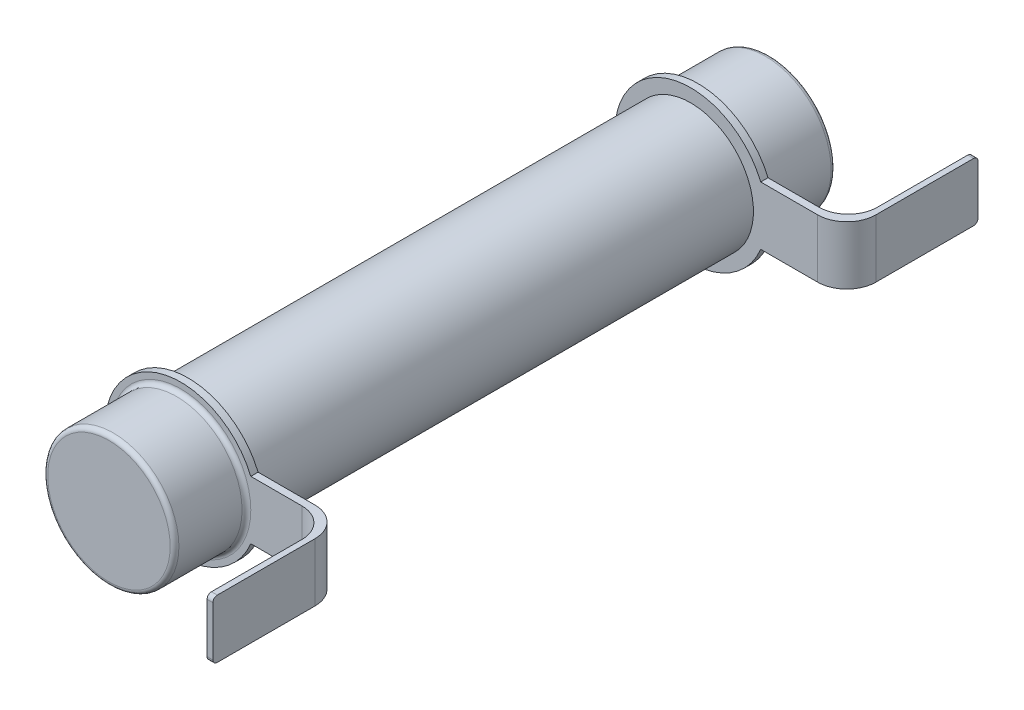
ISO-10303-21;
HEADER;
FILE_DESCRIPTION(('STEP AP214'),'2;1');
FILE_NAME('part.step','',(''),(''),'','','');
FILE_SCHEMA(('AUTOMOTIVE_DESIGN { 1 0 10303 214 1 1 1 1 }'));
ENDSEC;
DATA;
#1=APPLICATION_CONTEXT('core data for automotive mechanical design processes');
#2=APPLICATION_PROTOCOL_DEFINITION('international standard','automotive_design',2000,#1);
#3=PRODUCT_CONTEXT('',#1,'mechanical');
#4=PRODUCT('Part','Part','',(#3));
#5=PRODUCT_RELATED_PRODUCT_CATEGORY('part','',(#4));
#6=PRODUCT_DEFINITION_FORMATION('','',#4);
#7=PRODUCT_DEFINITION_CONTEXT('part definition',#1,'design');
#8=PRODUCT_DEFINITION('design','',#6,#7);
#9=PRODUCT_DEFINITION_SHAPE('','',#8);
#10=(LENGTH_UNIT() NAMED_UNIT(*) SI_UNIT(.MILLI.,.METRE.));
#11=(NAMED_UNIT(*) PLANE_ANGLE_UNIT() SI_UNIT($,.RADIAN.));
#12=(NAMED_UNIT(*) SI_UNIT($,.STERADIAN.) SOLID_ANGLE_UNIT());
#13=UNCERTAINTY_MEASURE_WITH_UNIT(LENGTH_MEASURE(1.E-05),#10,'distance_accuracy_value','');
#14=(GEOMETRIC_REPRESENTATION_CONTEXT(3) GLOBAL_UNCERTAINTY_ASSIGNED_CONTEXT((#13)) GLOBAL_UNIT_ASSIGNED_CONTEXT((#10,
#11,#12)) REPRESENTATION_CONTEXT('',''));
#15=CARTESIAN_POINT('',(0.,0.,0.));
#16=DIRECTION('',(0.,0.,1.));
#17=DIRECTION('',(1.,0.,0.));
#18=AXIS2_PLACEMENT_3D('',#15,#16,#17);
#19=CARTESIAN_POINT('',(0.,0.,17.735));
#20=DIRECTION('',(0.,0.,-1.));
#21=DIRECTION('',(-1.,0.,0.));
#22=AXIS2_PLACEMENT_3D('',#19,#20,#21);
#23=CYLINDRICAL_SURFACE('',#22,5.2);
#24=DIRECTION('',(0.,0.,-1.));
#25=VECTOR('',#24,1.);
#26=CARTESIAN_POINT('',(4.8,2.,17.735));
#27=LINE('',#26,#25);
#28=CARTESIAN_POINT('',(4.8,2.,17.735));
#29=VERTEX_POINT('',#28);
#30=CARTESIAN_POINT('',(4.8,2.,17.235));
#31=VERTEX_POINT('',#30);
#32=EDGE_CURVE('E201',#29,#31,#27,.T.);
#33=ORIENTED_EDGE('',*,*,#32,.T.);
#34=CARTESIAN_POINT('',(0.,0.,17.235));
#35=DIRECTION('',(0.,0.,1.));
#36=DIRECTION('',(1.,0.,0.));
#37=AXIS2_PLACEMENT_3D('',#34,#35,#36);
#38=CIRCLE('',#37,5.2);
#39=CARTESIAN_POINT('',(4.8,-2.,17.235));
#40=VERTEX_POINT('',#39);
#41=EDGE_CURVE('E186',#31,#40,#38,.T.);
#42=ORIENTED_EDGE('',*,*,#41,.T.);
#43=DIRECTION('',(0.,0.,-1.));
#44=VECTOR('',#43,1.);
#45=CARTESIAN_POINT('',(4.8,-2.,17.735));
#46=LINE('',#45,#44);
#47=CARTESIAN_POINT('',(4.8,-2.,17.735));
#48=VERTEX_POINT('',#47);
#49=EDGE_CURVE('E208',#40,#48,#46,.F.);
#50=ORIENTED_EDGE('',*,*,#49,.T.);
#51=CARTESIAN_POINT('',(0.,0.,17.735));
#52=DIRECTION('',(0.,0.,1.));
#53=DIRECTION('',(1.,0.,0.));
#54=AXIS2_PLACEMENT_3D('',#51,#52,#53);
#55=CIRCLE('',#54,5.2);
#56=EDGE_CURVE('E197',#29,#48,#55,.T.);
#57=ORIENTED_EDGE('',*,*,#56,.F.);
#58=EDGE_LOOP('',(#33,#42,#50,#57));
#59=FACE_BOUND('',#58,.T.);
#60=ADVANCED_FACE('F45',(#59),#23,.T.);
#61=CARTESIAN_POINT('',(0.,0.,-17.735));
#62=DIRECTION('',(0.,0.,1.));
#63=DIRECTION('',(1.,0.,0.));
#64=AXIS2_PLACEMENT_3D('',#61,#62,#63);
#65=CYLINDRICAL_SURFACE('',#64,5.2);
#66=CARTESIAN_POINT('',(0.,0.,-17.235));
#67=DIRECTION('',(0.,0.,1.));
#68=DIRECTION('',(1.,0.,0.));
#69=AXIS2_PLACEMENT_3D('',#66,#67,#68);
#70=CIRCLE('',#69,5.2);
#71=CARTESIAN_POINT('',(4.8,2.,-17.235));
#72=VERTEX_POINT('',#71);
#73=CARTESIAN_POINT('',(4.8,-2.,-17.235));
#74=VERTEX_POINT('',#73);
#75=EDGE_CURVE('E282',#72,#74,#70,.T.);
#76=ORIENTED_EDGE('',*,*,#75,.F.);
#77=DIRECTION('',(0.,0.,1.));
#78=VECTOR('',#77,1.);
#79=CARTESIAN_POINT('',(4.8,2.,-17.735));
#80=LINE('',#79,#78);
#81=CARTESIAN_POINT('',(4.8,2.,-17.735));
#82=VERTEX_POINT('',#81);
#83=EDGE_CURVE('E262',#82,#72,#80,.T.);
#84=ORIENTED_EDGE('',*,*,#83,.F.);
#85=CARTESIAN_POINT('',(0.,0.,-17.735));
#86=DIRECTION('',(0.,0.,1.));
#87=DIRECTION('',(1.,0.,0.));
#88=AXIS2_PLACEMENT_3D('',#85,#86,#87);
#89=CIRCLE('',#88,5.2);
#90=CARTESIAN_POINT('',(4.8,-2.,-17.735));
#91=VERTEX_POINT('',#90);
#92=EDGE_CURVE('E198',#82,#91,#89,.T.);
#93=ORIENTED_EDGE('',*,*,#92,.T.);
#94=DIRECTION('',(0.,0.,1.));
#95=VECTOR('',#94,1.);
#96=CARTESIAN_POINT('',(4.8,-2.,-17.735));
#97=LINE('',#96,#95);
#98=EDGE_CURVE('E256',#74,#91,#97,.F.);
#99=ORIENTED_EDGE('',*,*,#98,.F.);
#100=EDGE_LOOP('',(#76,#84,#93,#99));
#101=FACE_BOUND('',#100,.T.);
#102=ADVANCED_FACE('F439',(#101),#65,.T.);
#103=CARTESIAN_POINT('',(0.,0.,22.665));
#104=DIRECTION('',(0.,0.,-1.));
#105=DIRECTION('',(-1.,0.,0.));
#106=AXIS2_PLACEMENT_3D('',#103,#104,#105);
#107=CYLINDRICAL_SURFACE('',#106,4.3);
#108=CARTESIAN_POINT('',(0.,0.,17.235));
#109=DIRECTION('',(0.,0.,1.));
#110=DIRECTION('',(1.,0.,0.));
#111=AXIS2_PLACEMENT_3D('',#108,#109,#110);
#112=CIRCLE('',#111,4.3);
#113=CARTESIAN_POINT('',(4.3,0.,17.235));
#114=VERTEX_POINT('',#113);
#115=EDGE_CURVE('E288',#114,#114,#112,.T.);
#116=ORIENTED_EDGE('',*,*,#115,.F.);
#117=EDGE_LOOP('',(#116));
#118=FACE_BOUND('',#117,.T.);
#119=CARTESIAN_POINT('',(0.,0.,-17.235));
#120=DIRECTION('',(0.,0.,-1.));
#121=DIRECTION('',(-1.,0.,0.));
#122=AXIS2_PLACEMENT_3D('',#119,#120,#121);
#123=CIRCLE('',#122,4.3);
#124=CARTESIAN_POINT('',(-4.3,0.,-17.235));
#125=VERTEX_POINT('',#124);
#126=EDGE_CURVE('E293',#125,#125,#123,.T.);
#127=ORIENTED_EDGE('',*,*,#126,.F.);
#128=EDGE_LOOP('',(#127));
#129=FACE_BOUND('',#128,.T.);
#130=ADVANCED_FACE('F475',(#118,#129),#107,.T.);
#131=CARTESIAN_POINT('',(0.,0.,17.235));
#132=DIRECTION('',(0.,0.,1.));
#133=DIRECTION('',(1.,0.,0.));
#134=AXIS2_PLACEMENT_3D('',#131,#132,#133);
#135=PLANE('',#134);
#136=ORIENTED_EDGE('',*,*,#115,.T.);
#137=EDGE_LOOP('',(#136));
#138=FACE_BOUND('',#137,.T.);
#139=DIRECTION('',(1.,0.,0.));
#140=VECTOR('',#139,1.);
#141=CARTESIAN_POINT('',(-5.201,2.,17.235));
#142=LINE('',#141,#140);
#143=CARTESIAN_POINT('',(8.7,2.,17.235));
#144=VERTEX_POINT('',#143);
#145=EDGE_CURVE('E190',#31,#144,#142,.T.);
#146=ORIENTED_EDGE('',*,*,#145,.T.);
#147=DIRECTION('',(0.,1.,0.));
#148=VECTOR('',#147,1.);
#149=CARTESIAN_POINT('',(8.7,-2.,17.235));
#150=LINE('',#149,#148);
#151=CARTESIAN_POINT('',(8.7,-2.,17.235));
#152=VERTEX_POINT('',#151);
#153=EDGE_CURVE('E301',#144,#152,#150,.F.);
#154=ORIENTED_EDGE('',*,*,#153,.T.);
#155=DIRECTION('',(1.,0.,0.));
#156=VECTOR('',#155,1.);
#157=CARTESIAN_POINT('',(-5.201,-2.,17.235));
#158=LINE('',#157,#156);
#159=EDGE_CURVE('E193',#40,#152,#158,.T.);
#160=ORIENTED_EDGE('',*,*,#159,.F.);
#161=ORIENTED_EDGE('',*,*,#41,.F.);
#162=EDGE_LOOP('',(#146,#154,#160,#161));
#163=FACE_BOUND('',#162,.T.);
#164=ADVANCED_FACE('F188',(#138,#163),#135,.F.);
#165=CARTESIAN_POINT('',(0.,0.,17.735));
#166=DIRECTION('',(0.,0.,1.));
#167=DIRECTION('',(1.,0.,0.));
#168=AXIS2_PLACEMENT_3D('',#165,#166,#167);
#169=PLANE('',#168);
#170=CARTESIAN_POINT('',(0.,0.,17.735));
#171=DIRECTION('',(0.,0.,1.));
#172=DIRECTION('',(1.,0.,0.));
#173=AXIS2_PLACEMENT_3D('',#170,#171,#172);
#174=CIRCLE('',#173,4.8);
#175=CARTESIAN_POINT('',(4.8,0.,17.735));
#176=VERTEX_POINT('',#175);
#177=EDGE_CURVE('E11',#176,#176,#174,.F.);
#178=ORIENTED_EDGE('',*,*,#177,.T.);
#179=EDGE_LOOP('',(#178));
#180=FACE_BOUND('',#179,.T.);
#181=DIRECTION('',(1.,0.,0.));
#182=VECTOR('',#181,1.);
#183=CARTESIAN_POINT('',(-5.201,-2.,17.735));
#184=LINE('',#183,#182);
#185=CARTESIAN_POINT('',(8.3,-2.,17.735));
#186=VERTEX_POINT('',#185);
#187=EDGE_CURVE('E222',#48,#186,#184,.T.);
#188=ORIENTED_EDGE('',*,*,#187,.T.);
#189=DIRECTION('',(0.,1.,0.));
#190=VECTOR('',#189,1.);
#191=CARTESIAN_POINT('',(8.3,0.,17.735));
#192=LINE('',#191,#190);
#193=CARTESIAN_POINT('',(8.3,2.,17.735));
#194=VERTEX_POINT('',#193);
#195=EDGE_CURVE('E304',#186,#194,#192,.T.);
#196=ORIENTED_EDGE('',*,*,#195,.T.);
#197=DIRECTION('',(1.,0.,0.));
#198=VECTOR('',#197,1.);
#199=CARTESIAN_POINT('',(-5.201,2.,17.735));
#200=LINE('',#199,#198);
#201=EDGE_CURVE('E215',#29,#194,#200,.T.);
#202=ORIENTED_EDGE('',*,*,#201,.F.);
#203=ORIENTED_EDGE('',*,*,#56,.T.);
#204=EDGE_LOOP('',(#188,#196,#202,#203));
#205=FACE_BOUND('',#204,.T.);
#206=ADVANCED_FACE('F479',(#180,#205),#169,.T.);
#207=CARTESIAN_POINT('',(0.,0.,22.665));
#208=DIRECTION('',(0.,0.,1.));
#209=DIRECTION('',(1.,0.,0.));
#210=AXIS2_PLACEMENT_3D('',#207,#208,#209);
#211=PLANE('',#210);
#212=CARTESIAN_POINT('',(0.,0.,22.665));
#213=DIRECTION('',(0.,0.,1.));
#214=DIRECTION('',(1.,0.,0.));
#215=AXIS2_PLACEMENT_3D('',#212,#213,#214);
#216=CIRCLE('',#215,4.2);
#217=CARTESIAN_POINT('',(4.2,0.,22.665));
#218=VERTEX_POINT('',#217);
#219=EDGE_CURVE('E360',#218,#218,#216,.T.);
#220=ORIENTED_EDGE('',*,*,#219,.T.);
#221=EDGE_LOOP('',(#220));
#222=FACE_BOUND('',#221,.T.);
#223=ADVANCED_FACE('F486',(#222),#211,.T.);
#224=CARTESIAN_POINT('',(0.,0.,17.235));
#225=DIRECTION('',(0.,0.,1.));
#226=DIRECTION('',(1.,0.,0.));
#227=AXIS2_PLACEMENT_3D('',#224,#225,#226);
#228=CYLINDRICAL_SURFACE('',#227,4.5);
#229=CARTESIAN_POINT('',(0.,0.,22.365));
#230=DIRECTION('',(0.,0.,1.));
#231=DIRECTION('',(1.,0.,0.));
#232=AXIS2_PLACEMENT_3D('',#229,#230,#231);
#233=CIRCLE('',#232,4.5);
#234=CARTESIAN_POINT('',(4.5,0.,22.365));
#235=VERTEX_POINT('',#234);
#236=EDGE_CURVE('E368',#235,#235,#233,.F.);
#237=ORIENTED_EDGE('',*,*,#236,.T.);
#238=EDGE_LOOP('',(#237));
#239=FACE_BOUND('',#238,.T.);
#240=CARTESIAN_POINT('',(0.,0.,18.035));
#241=DIRECTION('',(0.,0.,1.));
#242=DIRECTION('',(1.,0.,0.));
#243=AXIS2_PLACEMENT_3D('',#240,#241,#242);
#244=CIRCLE('',#243,4.5);
#245=CARTESIAN_POINT('',(4.5,0.,18.035));
#246=VERTEX_POINT('',#245);
#247=EDGE_CURVE('E364',#246,#246,#244,.T.);
#248=ORIENTED_EDGE('',*,*,#247,.T.);
#249=EDGE_LOOP('',(#248));
#250=FACE_BOUND('',#249,.T.);
#251=ADVANCED_FACE('F483',(#239,#250),#228,.T.);
#252=CARTESIAN_POINT('',(0.,0.,-17.235));
#253=DIRECTION('',(0.,0.,-1.));
#254=DIRECTION('',(1.,0.,0.));
#255=AXIS2_PLACEMENT_3D('',#252,#253,#254);
#256=PLANE('',#255);
#257=ORIENTED_EDGE('',*,*,#126,.T.);
#258=EDGE_LOOP('',(#257));
#259=FACE_BOUND('',#258,.T.);
#260=DIRECTION('',(1.,0.,0.));
#261=VECTOR('',#260,1.);
#262=CARTESIAN_POINT('',(-5.201,-2.,-17.235));
#263=LINE('',#262,#261);
#264=CARTESIAN_POINT('',(8.7,-2.,-17.235));
#265=VERTEX_POINT('',#264);
#266=EDGE_CURVE('E246',#74,#265,#263,.T.);
#267=ORIENTED_EDGE('',*,*,#266,.T.);
#268=DIRECTION('',(0.,-1.,0.));
#269=VECTOR('',#268,1.);
#270=CARTESIAN_POINT('',(8.7,2.,-17.235));
#271=LINE('',#270,#269);
#272=CARTESIAN_POINT('',(8.7,2.,-17.235));
#273=VERTEX_POINT('',#272);
#274=EDGE_CURVE('E316',#265,#273,#271,.F.);
#275=ORIENTED_EDGE('',*,*,#274,.T.);
#276=DIRECTION('',(1.,0.,0.));
#277=VECTOR('',#276,1.);
#278=CARTESIAN_POINT('',(-5.201,2.,-17.235));
#279=LINE('',#278,#277);
#280=EDGE_CURVE('E266',#72,#273,#279,.T.);
#281=ORIENTED_EDGE('',*,*,#280,.F.);
#282=ORIENTED_EDGE('',*,*,#75,.T.);
#283=EDGE_LOOP('',(#267,#275,#281,#282));
#284=FACE_BOUND('',#283,.T.);
#285=ADVANCED_FACE('F435',(#259,#284),#256,.F.);
#286=CARTESIAN_POINT('',(0.,0.,-17.735));
#287=DIRECTION('',(0.,0.,-1.));
#288=DIRECTION('',(1.,0.,0.));
#289=AXIS2_PLACEMENT_3D('',#286,#287,#288);
#290=PLANE('',#289);
#291=CARTESIAN_POINT('',(0.,0.,-17.735));
#292=DIRECTION('',(0.,0.,1.));
#293=DIRECTION('',(1.,0.,0.));
#294=AXIS2_PLACEMENT_3D('',#291,#292,#293);
#295=CIRCLE('',#294,4.5);
#296=CARTESIAN_POINT('',(4.5,0.,-17.735));
#297=VERTEX_POINT('',#296);
#298=EDGE_CURVE('E272',#297,#297,#295,.T.);
#299=ORIENTED_EDGE('',*,*,#298,.T.);
#300=EDGE_LOOP('',(#299));
#301=FACE_BOUND('',#300,.T.);
#302=DIRECTION('',(1.,0.,0.));
#303=VECTOR('',#302,1.);
#304=CARTESIAN_POINT('',(-5.201,2.,-17.735));
#305=LINE('',#304,#303);
#306=CARTESIAN_POINT('',(8.3,2.,-17.735));
#307=VERTEX_POINT('',#306);
#308=EDGE_CURVE('E261',#82,#307,#305,.T.);
#309=ORIENTED_EDGE('',*,*,#308,.T.);
#310=DIRECTION('',(0.,-1.,0.));
#311=VECTOR('',#310,1.);
#312=CARTESIAN_POINT('',(8.3,0.,-17.735));
#313=LINE('',#312,#311);
#314=CARTESIAN_POINT('',(8.3,-2.,-17.735));
#315=VERTEX_POINT('',#314);
#316=EDGE_CURVE('E319',#307,#315,#313,.T.);
#317=ORIENTED_EDGE('',*,*,#316,.T.);
#318=DIRECTION('',(1.,0.,0.));
#319=VECTOR('',#318,1.);
#320=CARTESIAN_POINT('',(-5.201,-2.,-17.735));
#321=LINE('',#320,#319);
#322=EDGE_CURVE('E260',#91,#315,#321,.T.);
#323=ORIENTED_EDGE('',*,*,#322,.F.);
#324=ORIENTED_EDGE('',*,*,#92,.F.);
#325=EDGE_LOOP('',(#309,#317,#323,#324));
#326=FACE_BOUND('',#325,.T.);
#327=ADVANCED_FACE('F443',(#301,#326),#290,.T.);
#328=CARTESIAN_POINT('',(0.,0.,-22.665));
#329=DIRECTION('',(0.,0.,1.));
#330=DIRECTION('',(1.,0.,0.));
#331=AXIS2_PLACEMENT_3D('',#328,#329,#330);
#332=PLANE('',#331);
#333=CARTESIAN_POINT('',(0.,0.,-22.665));
#334=DIRECTION('',(0.,0.,1.));
#335=DIRECTION('',(1.,0.,0.));
#336=AXIS2_PLACEMENT_3D('',#333,#334,#335);
#337=CIRCLE('',#336,4.2);
#338=CARTESIAN_POINT('',(4.2,0.,-22.665));
#339=VERTEX_POINT('',#338);
#340=EDGE_CURVE('E356',#339,#339,#337,.F.);
#341=ORIENTED_EDGE('',*,*,#340,.T.);
#342=EDGE_LOOP('',(#341));
#343=FACE_BOUND('',#342,.T.);
#344=ADVANCED_FACE('F466',(#343),#332,.F.);
#345=CARTESIAN_POINT('',(0.,0.,-17.235));
#346=DIRECTION('',(0.,0.,-1.));
#347=DIRECTION('',(-1.,0.,0.));
#348=AXIS2_PLACEMENT_3D('',#345,#346,#347);
#349=CYLINDRICAL_SURFACE('',#348,4.5);
#350=CARTESIAN_POINT('',(0.,0.,-22.365));
#351=DIRECTION('',(0.,0.,1.));
#352=DIRECTION('',(1.,0.,0.));
#353=AXIS2_PLACEMENT_3D('',#350,#351,#352);
#354=CIRCLE('',#353,4.5);
#355=CARTESIAN_POINT('',(4.5,0.,-22.365));
#356=VERTEX_POINT('',#355);
#357=EDGE_CURVE('E352',#356,#356,#354,.T.);
#358=ORIENTED_EDGE('',*,*,#357,.T.);
#359=EDGE_LOOP('',(#358));
#360=FACE_BOUND('',#359,.T.);
#361=ORIENTED_EDGE('',*,*,#298,.F.);
#362=EDGE_LOOP('',(#361));
#363=FACE_BOUND('',#362,.T.);
#364=ADVANCED_FACE('F459',(#360,#363),#349,.T.);
#365=CARTESIAN_POINT('',(-5.201,2.,-17.735));
#366=DIRECTION('',(0.,-1.,0.));
#367=DIRECTION('',(0.,0.,-1.));
#368=AXIS2_PLACEMENT_3D('',#365,#366,#367);
#369=PLANE('',#368);
#370=DIRECTION('',(0.,0.,1.));
#371=VECTOR('',#370,1.);
#372=CARTESIAN_POINT('',(10.7,2.,-17.235));
#373=LINE('',#372,#371);
#374=CARTESIAN_POINT('',(10.7,2.,-25.935));
#375=VERTEX_POINT('',#374);
#376=CARTESIAN_POINT('',(10.7,2.,-19.235));
#377=VERTEX_POINT('',#376);
#378=EDGE_CURVE('E250',#375,#377,#373,.T.);
#379=ORIENTED_EDGE('',*,*,#378,.F.);
#380=DIRECTION('',(1.,0.,0.));
#381=VECTOR('',#380,1.);
#382=CARTESIAN_POINT('',(10.3,2.,-25.935));
#383=LINE('',#382,#381);
#384=CARTESIAN_POINT('',(10.3,2.,-25.935));
#385=VERTEX_POINT('',#384);
#386=EDGE_CURVE('E69',#375,#385,#383,.F.);
#387=ORIENTED_EDGE('',*,*,#386,.T.);
#388=DIRECTION('',(0.,0.,1.));
#389=VECTOR('',#388,1.);
#390=CARTESIAN_POINT('',(10.3,2.,-17.235));
#391=LINE('',#390,#389);
#392=CARTESIAN_POINT('',(10.3,2.,-19.735));
#393=VERTEX_POINT('',#392);
#394=EDGE_CURVE('E239',#385,#393,#391,.T.);
#395=ORIENTED_EDGE('',*,*,#394,.T.);
#396=CARTESIAN_POINT('',(8.3,2.,-19.735));
#397=DIRECTION('',(0.,-1.,0.));
#398=DIRECTION('',(0.,0.,-1.));
#399=AXIS2_PLACEMENT_3D('',#396,#397,#398);
#400=CIRCLE('',#399,2.);
#401=EDGE_CURVE('E336',#393,#307,#400,.T.);
#402=ORIENTED_EDGE('',*,*,#401,.T.);
#403=ORIENTED_EDGE('',*,*,#308,.F.);
#404=ORIENTED_EDGE('',*,*,#83,.T.);
#405=ORIENTED_EDGE('',*,*,#280,.T.);
#406=CARTESIAN_POINT('',(8.7,2.,-19.235));
#407=DIRECTION('',(0.,-1.,0.));
#408=DIRECTION('',(0.,0.,-1.));
#409=AXIS2_PLACEMENT_3D('',#406,#407,#408);
#410=CIRCLE('',#409,2.);
#411=EDGE_CURVE('E348',#273,#377,#410,.F.);
#412=ORIENTED_EDGE('',*,*,#411,.T.);
#413=EDGE_LOOP('',(#379,#387,#395,#402,#403,#404,#405,#412));
#414=FACE_BOUND('',#413,.T.);
#415=ADVANCED_FACE('F457',(#414),#369,.F.);
#416=CARTESIAN_POINT('',(-5.201,-2.,-17.735));
#417=DIRECTION('',(0.,1.,0.));
#418=DIRECTION('',(0.,0.,1.));
#419=AXIS2_PLACEMENT_3D('',#416,#417,#418);
#420=PLANE('',#419);
#421=DIRECTION('',(0.,0.,-1.));
#422=VECTOR('',#421,1.);
#423=CARTESIAN_POINT('',(10.3,-2.,-17.235));
#424=LINE('',#423,#422);
#425=CARTESIAN_POINT('',(10.3,-2.,-19.735));
#426=VERTEX_POINT('',#425);
#427=CARTESIAN_POINT('',(10.3,-2.,-25.935));
#428=VERTEX_POINT('',#427);
#429=EDGE_CURVE('E243',#426,#428,#424,.T.);
#430=ORIENTED_EDGE('',*,*,#429,.T.);
#431=DIRECTION('',(1.,0.,0.));
#432=VECTOR('',#431,1.);
#433=CARTESIAN_POINT('',(10.7,-2.,-25.935));
#434=LINE('',#433,#432);
#435=CARTESIAN_POINT('',(10.7,-2.,-25.935));
#436=VERTEX_POINT('',#435);
#437=EDGE_CURVE('E54',#428,#436,#434,.T.);
#438=ORIENTED_EDGE('',*,*,#437,.T.);
#439=DIRECTION('',(0.,0.,-1.));
#440=VECTOR('',#439,1.);
#441=CARTESIAN_POINT('',(10.7,-2.,-17.235));
#442=LINE('',#441,#440);
#443=CARTESIAN_POINT('',(10.7,-2.,-19.235));
#444=VERTEX_POINT('',#443);
#445=EDGE_CURVE('E240',#444,#436,#442,.T.);
#446=ORIENTED_EDGE('',*,*,#445,.F.);
#447=CARTESIAN_POINT('',(8.7,-2.,-19.235));
#448=DIRECTION('',(0.,1.,0.));
#449=DIRECTION('',(0.,0.,1.));
#450=AXIS2_PLACEMENT_3D('',#447,#448,#449);
#451=CIRCLE('',#450,2.);
#452=EDGE_CURVE('E345',#444,#265,#451,.F.);
#453=ORIENTED_EDGE('',*,*,#452,.T.);
#454=ORIENTED_EDGE('',*,*,#266,.F.);
#455=ORIENTED_EDGE('',*,*,#98,.T.);
#456=ORIENTED_EDGE('',*,*,#322,.T.);
#457=CARTESIAN_POINT('',(8.3,-2.,-19.735));
#458=DIRECTION('',(0.,1.,0.));
#459=DIRECTION('',(0.,0.,1.));
#460=AXIS2_PLACEMENT_3D('',#457,#458,#459);
#461=CIRCLE('',#460,2.);
#462=EDGE_CURVE('E333',#315,#426,#461,.T.);
#463=ORIENTED_EDGE('',*,*,#462,.T.);
#464=EDGE_LOOP('',(#430,#438,#446,#453,#454,#455,#456,#463));
#465=FACE_BOUND('',#464,.T.);
#466=ADVANCED_FACE('F423',(#465),#420,.F.);
#467=CARTESIAN_POINT('',(10.3,2.,-26.235));
#468=DIRECTION('',(0.,0.,-1.));
#469=DIRECTION('',(-1.,0.,0.));
#470=AXIS2_PLACEMENT_3D('',#467,#468,#469);
#471=PLANE('',#470);
#472=DIRECTION('',(0.,1.,0.));
#473=VECTOR('',#472,1.);
#474=CARTESIAN_POINT('',(10.3,2.,-26.235));
#475=LINE('',#474,#473);
#476=CARTESIAN_POINT('',(10.3,-1.7,-26.235));
#477=VERTEX_POINT('',#476);
#478=CARTESIAN_POINT('',(10.3,1.7,-26.235));
#479=VERTEX_POINT('',#478);
#480=EDGE_CURVE('E235',#477,#479,#475,.T.);
#481=ORIENTED_EDGE('',*,*,#480,.T.);
#482=DIRECTION('',(1.,0.,0.));
#483=VECTOR('',#482,1.);
#484=CARTESIAN_POINT('',(10.7,1.7,-26.235));
#485=LINE('',#484,#483);
#486=CARTESIAN_POINT('',(10.7,1.7,-26.235));
#487=VERTEX_POINT('',#486);
#488=EDGE_CURVE('E401',#479,#487,#485,.T.);
#489=ORIENTED_EDGE('',*,*,#488,.T.);
#490=DIRECTION('',(0.,1.,0.));
#491=VECTOR('',#490,1.);
#492=CARTESIAN_POINT('',(10.7,2.,-26.235));
#493=LINE('',#492,#491);
#494=CARTESIAN_POINT('',(10.7,-1.7,-26.235));
#495=VERTEX_POINT('',#494);
#496=EDGE_CURVE('E207',#495,#487,#493,.T.);
#497=ORIENTED_EDGE('',*,*,#496,.F.);
#498=DIRECTION('',(1.,0.,0.));
#499=VECTOR('',#498,1.);
#500=CARTESIAN_POINT('',(10.3,-1.7,-26.235));
#501=LINE('',#500,#499);
#502=EDGE_CURVE('E398',#495,#477,#501,.F.);
#503=ORIENTED_EDGE('',*,*,#502,.T.);
#504=EDGE_LOOP('',(#481,#489,#497,#503));
#505=FACE_BOUND('',#504,.T.);
#506=ADVANCED_FACE('F455',(#505),#471,.T.);
#507=CARTESIAN_POINT('',(10.3,0.,0.));
#508=DIRECTION('',(1.,0.,0.));
#509=DIRECTION('',(0.,0.,-1.));
#510=AXIS2_PLACEMENT_3D('',#507,#508,#509);
#511=PLANE('',#510);
#512=ORIENTED_EDGE('',*,*,#394,.F.);
#513=CARTESIAN_POINT('',(10.3,1.7,-25.935));
#514=DIRECTION('',(1.,0.,0.));
#515=DIRECTION('',(0.,0.,-1.));
#516=AXIS2_PLACEMENT_3D('',#513,#514,#515);
#517=CIRCLE('',#516,0.3);
#518=EDGE_CURVE('E415',#385,#479,#517,.F.);
#519=ORIENTED_EDGE('',*,*,#518,.T.);
#520=ORIENTED_EDGE('',*,*,#480,.F.);
#521=CARTESIAN_POINT('',(10.3,-1.7,-25.935));
#522=DIRECTION('',(1.,0.,0.));
#523=DIRECTION('',(0.,0.,-1.));
#524=AXIS2_PLACEMENT_3D('',#521,#522,#523);
#525=CIRCLE('',#524,0.3);
#526=EDGE_CURVE('E61',#477,#428,#525,.F.);
#527=ORIENTED_EDGE('',*,*,#526,.T.);
#528=ORIENTED_EDGE('',*,*,#429,.F.);
#529=DIRECTION('',(0.,-1.,0.));
#530=VECTOR('',#529,1.);
#531=CARTESIAN_POINT('',(10.3,0.,-19.735));
#532=LINE('',#531,#530);
#533=EDGE_CURVE('E323',#426,#393,#532,.F.);
#534=ORIENTED_EDGE('',*,*,#533,.T.);
#535=EDGE_LOOP('',(#512,#519,#520,#527,#528,#534));
#536=FACE_BOUND('',#535,.T.);
#537=ADVANCED_FACE('F449',(#536),#511,.F.);
#538=CARTESIAN_POINT('',(10.7,0.,0.));
#539=DIRECTION('',(1.,0.,0.));
#540=DIRECTION('',(0.,0.,-1.));
#541=AXIS2_PLACEMENT_3D('',#538,#539,#540);
#542=PLANE('',#541);
#543=ORIENTED_EDGE('',*,*,#496,.T.);
#544=CARTESIAN_POINT('',(10.7,1.7,-25.935));
#545=DIRECTION('',(1.,0.,0.));
#546=DIRECTION('',(0.,0.,-1.));
#547=AXIS2_PLACEMENT_3D('',#544,#545,#546);
#548=CIRCLE('',#547,0.3);
#549=EDGE_CURVE('E408',#487,#375,#548,.T.);
#550=ORIENTED_EDGE('',*,*,#549,.T.);
#551=ORIENTED_EDGE('',*,*,#378,.T.);
#552=DIRECTION('',(0.,-1.,0.));
#553=VECTOR('',#552,1.);
#554=CARTESIAN_POINT('',(10.7,-2.,-19.235));
#555=LINE('',#554,#553);
#556=EDGE_CURVE('E312',#377,#444,#555,.T.);
#557=ORIENTED_EDGE('',*,*,#556,.T.);
#558=ORIENTED_EDGE('',*,*,#445,.T.);
#559=CARTESIAN_POINT('',(10.7,-1.7,-25.935));
#560=DIRECTION('',(1.,0.,0.));
#561=DIRECTION('',(0.,0.,-1.));
#562=AXIS2_PLACEMENT_3D('',#559,#560,#561);
#563=CIRCLE('',#562,0.3);
#564=EDGE_CURVE('E405',#436,#495,#563,.T.);
#565=ORIENTED_EDGE('',*,*,#564,.T.);
#566=EDGE_LOOP('',(#543,#550,#551,#557,#558,#565));
#567=FACE_BOUND('',#566,.T.);
#568=ADVANCED_FACE('F426',(#567),#542,.T.);
#569=CARTESIAN_POINT('',(-5.201,2.,17.235));
#570=DIRECTION('',(0.,-1.,0.));
#571=DIRECTION('',(0.,0.,-1.));
#572=AXIS2_PLACEMENT_3D('',#569,#570,#571);
#573=PLANE('',#572);
#574=DIRECTION('',(0.,0.,1.));
#575=VECTOR('',#574,1.);
#576=CARTESIAN_POINT('',(10.3,2.,26.235));
#577=LINE('',#576,#575);
#578=CARTESIAN_POINT('',(10.3,2.,19.735));
#579=VERTEX_POINT('',#578);
#580=CARTESIAN_POINT('',(10.3,2.,25.935));
#581=VERTEX_POINT('',#580);
#582=EDGE_CURVE('E547',#579,#581,#577,.T.);
#583=ORIENTED_EDGE('',*,*,#582,.T.);
#584=DIRECTION('',(1.,0.,0.));
#585=VECTOR('',#584,1.);
#586=CARTESIAN_POINT('',(10.7,2.,25.935));
#587=LINE('',#586,#585);
#588=CARTESIAN_POINT('',(10.7,2.,25.935));
#589=VERTEX_POINT('',#588);
#590=EDGE_CURVE('E372',#581,#589,#587,.T.);
#591=ORIENTED_EDGE('',*,*,#590,.T.);
#592=DIRECTION('',(0.,0.,1.));
#593=VECTOR('',#592,1.);
#594=CARTESIAN_POINT('',(10.7,2.,26.235));
#595=LINE('',#594,#593);
#596=CARTESIAN_POINT('',(10.7,2.,19.235));
#597=VERTEX_POINT('',#596);
#598=EDGE_CURVE('E564',#597,#589,#595,.T.);
#599=ORIENTED_EDGE('',*,*,#598,.F.);
#600=CARTESIAN_POINT('',(8.7,2.,19.235));
#601=DIRECTION('',(0.,-1.,0.));
#602=DIRECTION('',(0.,0.,-1.));
#603=AXIS2_PLACEMENT_3D('',#600,#601,#602);
#604=CIRCLE('',#603,2.);
#605=EDGE_CURVE('E213',#597,#144,#604,.F.);
#606=ORIENTED_EDGE('',*,*,#605,.T.);
#607=ORIENTED_EDGE('',*,*,#145,.F.);
#608=ORIENTED_EDGE('',*,*,#32,.F.);
#609=ORIENTED_EDGE('',*,*,#201,.T.);
#610=CARTESIAN_POINT('',(8.3,2.,19.735));
#611=DIRECTION('',(0.,-1.,0.));
#612=DIRECTION('',(0.,0.,-1.));
#613=AXIS2_PLACEMENT_3D('',#610,#611,#612);
#614=CIRCLE('',#613,2.);
#615=EDGE_CURVE('E327',#194,#579,#614,.T.);
#616=ORIENTED_EDGE('',*,*,#615,.T.);
#617=EDGE_LOOP('',(#583,#591,#599,#606,#607,#608,#609,#616));
#618=FACE_BOUND('',#617,.T.);
#619=ADVANCED_FACE('F211',(#618),#573,.F.);
#620=CARTESIAN_POINT('',(-5.201,-2.,17.235));
#621=DIRECTION('',(0.,1.,0.));
#622=DIRECTION('',(0.,0.,1.));
#623=AXIS2_PLACEMENT_3D('',#620,#621,#622);
#624=PLANE('',#623);
#625=DIRECTION('',(0.,0.,-1.));
#626=VECTOR('',#625,1.);
#627=CARTESIAN_POINT('',(10.7,-2.,26.235));
#628=LINE('',#627,#626);
#629=CARTESIAN_POINT('',(10.7,-2.,25.935));
#630=VERTEX_POINT('',#629);
#631=CARTESIAN_POINT('',(10.7,-2.,19.235));
#632=VERTEX_POINT('',#631);
#633=EDGE_CURVE('E555',#630,#632,#628,.T.);
#634=ORIENTED_EDGE('',*,*,#633,.F.);
#635=DIRECTION('',(1.,0.,0.));
#636=VECTOR('',#635,1.);
#637=CARTESIAN_POINT('',(10.3,-2.,25.935));
#638=LINE('',#637,#636);
#639=CARTESIAN_POINT('',(10.3,-2.,25.935));
#640=VERTEX_POINT('',#639);
#641=EDGE_CURVE('E395',#630,#640,#638,.F.);
#642=ORIENTED_EDGE('',*,*,#641,.T.);
#643=DIRECTION('',(0.,0.,-1.));
#644=VECTOR('',#643,1.);
#645=CARTESIAN_POINT('',(10.3,-2.,26.235));
#646=LINE('',#645,#644);
#647=CARTESIAN_POINT('',(10.3,-2.,19.735));
#648=VERTEX_POINT('',#647);
#649=EDGE_CURVE('E216',#640,#648,#646,.T.);
#650=ORIENTED_EDGE('',*,*,#649,.T.);
#651=CARTESIAN_POINT('',(8.3,-2.,19.735));
#652=DIRECTION('',(0.,1.,0.));
#653=DIRECTION('',(0.,0.,1.));
#654=AXIS2_PLACEMENT_3D('',#651,#652,#653);
#655=CIRCLE('',#654,2.);
#656=EDGE_CURVE('E330',#648,#186,#655,.T.);
#657=ORIENTED_EDGE('',*,*,#656,.T.);
#658=ORIENTED_EDGE('',*,*,#187,.F.);
#659=ORIENTED_EDGE('',*,*,#49,.F.);
#660=ORIENTED_EDGE('',*,*,#159,.T.);
#661=CARTESIAN_POINT('',(8.7,-2.,19.235));
#662=DIRECTION('',(0.,1.,0.));
#663=DIRECTION('',(0.,0.,1.));
#664=AXIS2_PLACEMENT_3D('',#661,#662,#663);
#665=CIRCLE('',#664,2.);
#666=EDGE_CURVE('E341',#152,#632,#665,.F.);
#667=ORIENTED_EDGE('',*,*,#666,.T.);
#668=EDGE_LOOP('',(#634,#642,#650,#657,#658,#659,#660,#667));
#669=FACE_BOUND('',#668,.T.);
#670=ADVANCED_FACE('F580',(#669),#624,.F.);
#671=CARTESIAN_POINT('',(10.3,2.,26.235));
#672=DIRECTION('',(0.,0.,1.));
#673=DIRECTION('',(1.,0.,0.));
#674=AXIS2_PLACEMENT_3D('',#671,#672,#673);
#675=PLANE('',#674);
#676=DIRECTION('',(0.,-1.,0.));
#677=VECTOR('',#676,1.);
#678=CARTESIAN_POINT('',(10.7,2.,26.235));
#679=LINE('',#678,#677);
#680=CARTESIAN_POINT('',(10.7,1.7,26.235));
#681=VERTEX_POINT('',#680);
#682=CARTESIAN_POINT('',(10.7,-1.7,26.235));
#683=VERTEX_POINT('',#682);
#684=EDGE_CURVE('E562',#681,#683,#679,.T.);
#685=ORIENTED_EDGE('',*,*,#684,.F.);
#686=DIRECTION('',(1.,0.,0.));
#687=VECTOR('',#686,1.);
#688=CARTESIAN_POINT('',(10.3,1.7,26.235));
#689=LINE('',#688,#687);
#690=CARTESIAN_POINT('',(10.3,1.7,26.235));
#691=VERTEX_POINT('',#690);
#692=EDGE_CURVE('E386',#681,#691,#689,.F.);
#693=ORIENTED_EDGE('',*,*,#692,.T.);
#694=DIRECTION('',(0.,-1.,0.));
#695=VECTOR('',#694,1.);
#696=CARTESIAN_POINT('',(10.3,2.,26.235));
#697=LINE('',#696,#695);
#698=CARTESIAN_POINT('',(10.3,-1.7,26.235));
#699=VERTEX_POINT('',#698);
#700=EDGE_CURVE('E225',#691,#699,#697,.T.);
#701=ORIENTED_EDGE('',*,*,#700,.T.);
#702=DIRECTION('',(1.,0.,0.));
#703=VECTOR('',#702,1.);
#704=CARTESIAN_POINT('',(10.7,-1.7,26.235));
#705=LINE('',#704,#703);
#706=EDGE_CURVE('E382',#699,#683,#705,.T.);
#707=ORIENTED_EDGE('',*,*,#706,.T.);
#708=EDGE_LOOP('',(#685,#693,#701,#707));
#709=FACE_BOUND('',#708,.T.);
#710=ADVANCED_FACE('F576',(#709),#675,.T.);
#711=CARTESIAN_POINT('',(10.3,0.,0.));
#712=DIRECTION('',(1.,0.,0.));
#713=DIRECTION('',(0.,0.,-1.));
#714=AXIS2_PLACEMENT_3D('',#711,#712,#713);
#715=PLANE('',#714);
#716=ORIENTED_EDGE('',*,*,#700,.F.);
#717=CARTESIAN_POINT('',(10.3,1.7,25.935));
#718=DIRECTION('',(1.,0.,0.));
#719=DIRECTION('',(0.,0.,-1.));
#720=AXIS2_PLACEMENT_3D('',#717,#718,#719);
#721=CIRCLE('',#720,0.3);
#722=EDGE_CURVE('E392',#691,#581,#721,.F.);
#723=ORIENTED_EDGE('',*,*,#722,.T.);
#724=ORIENTED_EDGE('',*,*,#582,.F.);
#725=DIRECTION('',(0.,1.,0.));
#726=VECTOR('',#725,1.);
#727=CARTESIAN_POINT('',(10.3,0.,19.735));
#728=LINE('',#727,#726);
#729=EDGE_CURVE('E308',#579,#648,#728,.F.);
#730=ORIENTED_EDGE('',*,*,#729,.T.);
#731=ORIENTED_EDGE('',*,*,#649,.F.);
#732=CARTESIAN_POINT('',(10.3,-1.7,25.935));
#733=DIRECTION('',(1.,0.,0.));
#734=DIRECTION('',(0.,0.,-1.));
#735=AXIS2_PLACEMENT_3D('',#732,#733,#734);
#736=CIRCLE('',#735,0.3);
#737=EDGE_CURVE('E389',#640,#699,#736,.F.);
#738=ORIENTED_EDGE('',*,*,#737,.T.);
#739=EDGE_LOOP('',(#716,#723,#724,#730,#731,#738));
#740=FACE_BOUND('',#739,.T.);
#741=ADVANCED_FACE('F551',(#740),#715,.F.);
#742=CARTESIAN_POINT('',(10.7,0.,0.));
#743=DIRECTION('',(1.,0.,0.));
#744=DIRECTION('',(0.,0.,-1.));
#745=AXIS2_PLACEMENT_3D('',#742,#743,#744);
#746=PLANE('',#745);
#747=ORIENTED_EDGE('',*,*,#598,.T.);
#748=CARTESIAN_POINT('',(10.7,1.7,25.935));
#749=DIRECTION('',(1.,0.,0.));
#750=DIRECTION('',(0.,0.,-1.));
#751=AXIS2_PLACEMENT_3D('',#748,#749,#750);
#752=CIRCLE('',#751,0.3);
#753=EDGE_CURVE('E379',#589,#681,#752,.T.);
#754=ORIENTED_EDGE('',*,*,#753,.T.);
#755=ORIENTED_EDGE('',*,*,#684,.T.);
#756=CARTESIAN_POINT('',(10.7,-1.7,25.935));
#757=DIRECTION('',(1.,0.,0.));
#758=DIRECTION('',(0.,0.,-1.));
#759=AXIS2_PLACEMENT_3D('',#756,#757,#758);
#760=CIRCLE('',#759,0.3);
#761=EDGE_CURVE('E376',#683,#630,#760,.T.);
#762=ORIENTED_EDGE('',*,*,#761,.T.);
#763=ORIENTED_EDGE('',*,*,#633,.T.);
#764=DIRECTION('',(0.,1.,0.));
#765=VECTOR('',#764,1.);
#766=CARTESIAN_POINT('',(10.7,2.,19.235));
#767=LINE('',#766,#765);
#768=EDGE_CURVE('E297',#632,#597,#767,.T.);
#769=ORIENTED_EDGE('',*,*,#768,.T.);
#770=EDGE_LOOP('',(#747,#754,#755,#762,#763,#769));
#771=FACE_BOUND('',#770,.T.);
#772=ADVANCED_FACE('F501',(#771),#746,.T.);
#773=CARTESIAN_POINT('',(8.7,0.,19.235));
#774=DIRECTION('',(0.,-1.,0.));
#775=DIRECTION('',(0.,0.,-1.));
#776=AXIS2_PLACEMENT_3D('',#773,#774,#775);
#777=CYLINDRICAL_SURFACE('',#776,2.);
#778=ORIENTED_EDGE('',*,*,#666,.F.);
#779=ORIENTED_EDGE('',*,*,#153,.F.);
#780=ORIENTED_EDGE('',*,*,#605,.F.);
#781=ORIENTED_EDGE('',*,*,#768,.F.);
#782=EDGE_LOOP('',(#778,#779,#780,#781));
#783=FACE_BOUND('',#782,.T.);
#784=ADVANCED_FACE('F497',(#783),#777,.T.);
#785=CARTESIAN_POINT('',(8.3,0.,19.735));
#786=DIRECTION('',(0.,1.,0.));
#787=DIRECTION('',(0.,0.,1.));
#788=AXIS2_PLACEMENT_3D('',#785,#786,#787);
#789=CYLINDRICAL_SURFACE('',#788,2.);
#790=ORIENTED_EDGE('',*,*,#656,.F.);
#791=ORIENTED_EDGE('',*,*,#729,.F.);
#792=ORIENTED_EDGE('',*,*,#615,.F.);
#793=ORIENTED_EDGE('',*,*,#195,.F.);
#794=EDGE_LOOP('',(#790,#791,#792,#793));
#795=FACE_BOUND('',#794,.T.);
#796=ADVANCED_FACE('F500',(#795),#789,.F.);
#797=CARTESIAN_POINT('',(8.7,0.,-19.235));
#798=DIRECTION('',(0.,1.,0.));
#799=DIRECTION('',(0.,0.,1.));
#800=AXIS2_PLACEMENT_3D('',#797,#798,#799);
#801=CYLINDRICAL_SURFACE('',#800,2.);
#802=ORIENTED_EDGE('',*,*,#411,.F.);
#803=ORIENTED_EDGE('',*,*,#274,.F.);
#804=ORIENTED_EDGE('',*,*,#452,.F.);
#805=ORIENTED_EDGE('',*,*,#556,.F.);
#806=EDGE_LOOP('',(#802,#803,#804,#805));
#807=FACE_BOUND('',#806,.T.);
#808=ADVANCED_FACE('F431',(#807),#801,.T.);
#809=CARTESIAN_POINT('',(8.3,0.,-19.735));
#810=DIRECTION('',(0.,-1.,0.));
#811=DIRECTION('',(0.,0.,-1.));
#812=AXIS2_PLACEMENT_3D('',#809,#810,#811);
#813=CYLINDRICAL_SURFACE('',#812,2.);
#814=ORIENTED_EDGE('',*,*,#401,.F.);
#815=ORIENTED_EDGE('',*,*,#533,.F.);
#816=ORIENTED_EDGE('',*,*,#462,.F.);
#817=ORIENTED_EDGE('',*,*,#316,.F.);
#818=EDGE_LOOP('',(#814,#815,#816,#817));
#819=FACE_BOUND('',#818,.T.);
#820=ADVANCED_FACE('F447',(#819),#813,.F.);
#821=CARTESIAN_POINT('',(0.,0.,-22.365));
#822=DIRECTION('',(0.,0.,1.));
#823=DIRECTION('',(1.,0.,0.));
#824=AXIS2_PLACEMENT_3D('',#821,#822,#823);
#825=TOROIDAL_SURFACE('',#824,4.2,0.3);
#826=ORIENTED_EDGE('',*,*,#340,.F.);
#827=EDGE_LOOP('',(#826));
#828=FACE_BOUND('',#827,.T.);
#829=ORIENTED_EDGE('',*,*,#357,.F.);
#830=EDGE_LOOP('',(#829));
#831=FACE_BOUND('',#830,.T.);
#832=ADVANCED_FACE('F510',(#828,#831),#825,.T.);
#833=CARTESIAN_POINT('',(0.,0.,22.365));
#834=DIRECTION('',(0.,0.,1.));
#835=DIRECTION('',(1.,0.,0.));
#836=AXIS2_PLACEMENT_3D('',#833,#834,#835);
#837=TOROIDAL_SURFACE('',#836,4.2,0.3);
#838=ORIENTED_EDGE('',*,*,#236,.F.);
#839=EDGE_LOOP('',(#838));
#840=FACE_BOUND('',#839,.T.);
#841=ORIENTED_EDGE('',*,*,#219,.F.);
#842=EDGE_LOOP('',(#841));
#843=FACE_BOUND('',#842,.T.);
#844=ADVANCED_FACE('F513',(#840,#843),#837,.T.);
#845=CARTESIAN_POINT('',(-5.201,1.7,25.935));
#846=DIRECTION('',(-1.,0.,0.));
#847=DIRECTION('',(0.,0.,1.));
#848=AXIS2_PLACEMENT_3D('',#845,#846,#847);
#849=CYLINDRICAL_SURFACE('',#848,0.3);
#850=ORIENTED_EDGE('',*,*,#722,.F.);
#851=ORIENTED_EDGE('',*,*,#692,.F.);
#852=ORIENTED_EDGE('',*,*,#753,.F.);
#853=ORIENTED_EDGE('',*,*,#590,.F.);
#854=EDGE_LOOP('',(#850,#851,#852,#853));
#855=FACE_BOUND('',#854,.T.);
#856=ADVANCED_FACE('F517',(#855),#849,.T.);
#857=CARTESIAN_POINT('',(10.3,-1.7,25.935));
#858=DIRECTION('',(-1.,0.,0.));
#859=DIRECTION('',(0.,0.,1.));
#860=AXIS2_PLACEMENT_3D('',#857,#858,#859);
#861=CYLINDRICAL_SURFACE('',#860,0.3);
#862=ORIENTED_EDGE('',*,*,#737,.F.);
#863=ORIENTED_EDGE('',*,*,#641,.F.);
#864=ORIENTED_EDGE('',*,*,#761,.F.);
#865=ORIENTED_EDGE('',*,*,#706,.F.);
#866=EDGE_LOOP('',(#862,#863,#864,#865));
#867=FACE_BOUND('',#866,.T.);
#868=ADVANCED_FACE('F521',(#867),#861,.T.);
#869=CARTESIAN_POINT('',(10.3,1.7,-25.935));
#870=DIRECTION('',(-1.,0.,0.));
#871=DIRECTION('',(0.,0.,1.));
#872=AXIS2_PLACEMENT_3D('',#869,#870,#871);
#873=CYLINDRICAL_SURFACE('',#872,0.3);
#874=ORIENTED_EDGE('',*,*,#518,.F.);
#875=ORIENTED_EDGE('',*,*,#386,.F.);
#876=ORIENTED_EDGE('',*,*,#549,.F.);
#877=ORIENTED_EDGE('',*,*,#488,.F.);
#878=EDGE_LOOP('',(#874,#875,#876,#877));
#879=FACE_BOUND('',#878,.T.);
#880=ADVANCED_FACE('F453',(#879),#873,.T.);
#881=CARTESIAN_POINT('',(-5.201,-1.7,-25.935));
#882=DIRECTION('',(-1.,0.,0.));
#883=DIRECTION('',(0.,0.,1.));
#884=AXIS2_PLACEMENT_3D('',#881,#882,#883);
#885=CYLINDRICAL_SURFACE('',#884,0.3);
#886=ORIENTED_EDGE('',*,*,#526,.F.);
#887=ORIENTED_EDGE('',*,*,#502,.F.);
#888=ORIENTED_EDGE('',*,*,#564,.F.);
#889=ORIENTED_EDGE('',*,*,#437,.F.);
#890=EDGE_LOOP('',(#886,#887,#888,#889));
#891=FACE_BOUND('',#890,.T.);
#892=ADVANCED_FACE('F527',(#891),#885,.T.);
#893=CARTESIAN_POINT('',(0.,0.,18.035));
#894=DIRECTION('',(0.,0.,1.));
#895=DIRECTION('',(1.,0.,0.));
#896=AXIS2_PLACEMENT_3D('',#893,#894,#895);
#897=TOROIDAL_SURFACE('',#896,4.8,0.3);
#898=ORIENTED_EDGE('',*,*,#247,.F.);
#899=EDGE_LOOP('',(#898));
#900=FACE_BOUND('',#899,.T.);
#901=ORIENTED_EDGE('',*,*,#177,.F.);
#902=EDGE_LOOP('',(#901));
#903=FACE_BOUND('',#902,.T.);
#904=ADVANCED_FACE('F47',(#900,#903),#897,.F.);
#905=CLOSED_SHELL('',(#60,#102,#130,#164,#206,#223,#251,#285,#327,#344,#364,#415,#466,#506,#537,
#568,#619,#670,#710,#741,#772,#784,#796,#808,#820,#832,#844,#856,#868,#880,#892,#904));
#906=MANIFOLD_SOLID_BREP('B2',#905);
#907=ADVANCED_BREP_SHAPE_REPRESENTATION('',(#18,#906),#14);
#908=SHAPE_DEFINITION_REPRESENTATION(#9,#907);
ENDSEC;
END-ISO-10303-21;
